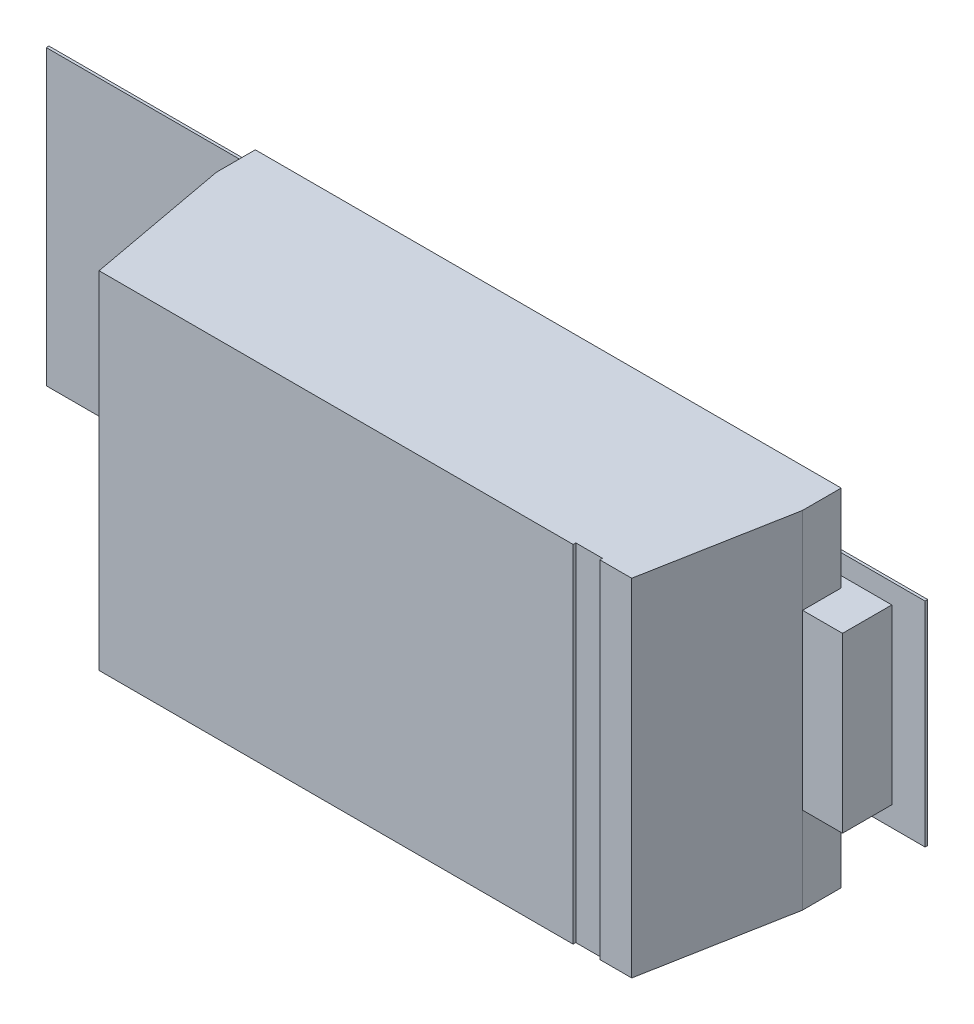
ISO-10303-21;
HEADER;
FILE_DESCRIPTION(('STEP AP214'),'2;1');
FILE_NAME('part.step','',(''),(''),'','','');
FILE_SCHEMA(('AUTOMOTIVE_DESIGN { 1 0 10303 214 1 1 1 1 }'));
ENDSEC;
DATA;
#1=APPLICATION_CONTEXT('core data for automotive mechanical design processes');
#2=APPLICATION_PROTOCOL_DEFINITION('international standard','automotive_design',2000,#1);
#3=PRODUCT_CONTEXT('',#1,'mechanical');
#4=PRODUCT('Part','Part','',(#3));
#5=PRODUCT_RELATED_PRODUCT_CATEGORY('part','',(#4));
#6=PRODUCT_DEFINITION_FORMATION('','',#4);
#7=PRODUCT_DEFINITION_CONTEXT('part definition',#1,'design');
#8=PRODUCT_DEFINITION('design','',#6,#7);
#9=PRODUCT_DEFINITION_SHAPE('','',#8);
#10=(LENGTH_UNIT() NAMED_UNIT(*) SI_UNIT(.MILLI.,.METRE.));
#11=(NAMED_UNIT(*) PLANE_ANGLE_UNIT() SI_UNIT($,.RADIAN.));
#12=(NAMED_UNIT(*) SI_UNIT($,.STERADIAN.) SOLID_ANGLE_UNIT());
#13=UNCERTAINTY_MEASURE_WITH_UNIT(LENGTH_MEASURE(1.E-05),#10,'distance_accuracy_value','');
#14=(GEOMETRIC_REPRESENTATION_CONTEXT(3) GLOBAL_UNCERTAINTY_ASSIGNED_CONTEXT((#13)) GLOBAL_UNIT_ASSIGNED_CONTEXT((#10,
#11,#12)) REPRESENTATION_CONTEXT('',''));
#15=CARTESIAN_POINT('',(0.,0.,0.));
#16=DIRECTION('',(0.,0.,1.));
#17=DIRECTION('',(1.,0.,0.));
#18=AXIS2_PLACEMENT_3D('',#15,#16,#17);
#19=CARTESIAN_POINT('',(0.,0.,0.0762));
#20=DIRECTION('',(0.,0.,1.));
#21=DIRECTION('',(1.,0.,0.));
#22=AXIS2_PLACEMENT_3D('',#19,#20,#21);
#23=PLANE('',#22);
#24=DIRECTION('',(1.,0.,0.));
#25=VECTOR('',#24,1.);
#26=CARTESIAN_POINT('',(-1.92499999999992,-0.550000000000086,0.0762));
#27=LINE('',#26,#25);
#28=CARTESIAN_POINT('',(-1.92499999999992,-0.550000000000086,0.0762));
#29=VERTEX_POINT('',#28);
#30=CARTESIAN_POINT('',(0.0750000000000049,-0.550000000000086,0.0762));
#31=VERTEX_POINT('',#30);
#32=EDGE_CURVE('E212',#29,#31,#27,.T.);
#33=ORIENTED_EDGE('',*,*,#32,.F.);
#34=DIRECTION('',(0.,1.,0.));
#35=VECTOR('',#34,1.);
#36=CARTESIAN_POINT('',(-1.92499999999992,0.550000000000086,0.0762));
#37=LINE('',#36,#35);
#38=CARTESIAN_POINT('',(-1.92499999999992,0.550000000000086,0.0762));
#39=VERTEX_POINT('',#38);
#40=EDGE_CURVE('E20',#39,#29,#37,.F.);
#41=ORIENTED_EDGE('',*,*,#40,.F.);
#42=DIRECTION('',(1.,0.,0.));
#43=VECTOR('',#42,1.);
#44=CARTESIAN_POINT('',(0.0750000000000048,0.550000000000086,0.0762));
#45=LINE('',#44,#43);
#46=CARTESIAN_POINT('',(0.0750000000000048,0.550000000000086,0.0762));
#47=VERTEX_POINT('',#46);
#48=EDGE_CURVE('E240',#47,#39,#45,.F.);
#49=ORIENTED_EDGE('',*,*,#48,.F.);
#50=DIRECTION('',(0.,1.,0.));
#51=VECTOR('',#50,1.);
#52=CARTESIAN_POINT('',(0.0750000000000048,-0.550000000000086,0.0762));
#53=LINE('',#52,#51);
#54=EDGE_CURVE('E225',#31,#47,#53,.T.);
#55=ORIENTED_EDGE('',*,*,#54,.F.);
#56=EDGE_LOOP('',(#33,#41,#49,#55));
#57=FACE_BOUND('',#56,.T.);
#58=ADVANCED_FACE('F17',(#57),#23,.F.);
#59=CARTESIAN_POINT('',(0.,0.,0.0762));
#60=DIRECTION('',(0.,0.,1.));
#61=DIRECTION('',(1.,0.,0.));
#62=AXIS2_PLACEMENT_3D('',#59,#60,#61);
#63=PLANE('',#62);
#64=DIRECTION('',(0.,1.,0.));
#65=VECTOR('',#64,1.);
#66=CARTESIAN_POINT('',(1.37500000000009,-0.399999999999924,0.0762));
#67=LINE('',#66,#65);
#68=CARTESIAN_POINT('',(1.37500000000009,-0.399999999999924,0.0762));
#69=VERTEX_POINT('',#68);
#70=CARTESIAN_POINT('',(1.37500000000009,0.399999999999924,0.0762));
#71=VERTEX_POINT('',#70);
#72=EDGE_CURVE('E247',#69,#71,#67,.T.);
#73=ORIENTED_EDGE('',*,*,#72,.F.);
#74=DIRECTION('',(1.,0.,0.));
#75=VECTOR('',#74,1.);
#76=CARTESIAN_POINT('',(0.574999999999986,-0.399999999999924,0.0762));
#77=LINE('',#76,#75);
#78=CARTESIAN_POINT('',(0.574999999999986,-0.399999999999924,0.0762));
#79=VERTEX_POINT('',#78);
#80=EDGE_CURVE('E242',#79,#69,#77,.T.);
#81=ORIENTED_EDGE('',*,*,#80,.F.);
#82=DIRECTION('',(0.,1.,0.));
#83=VECTOR('',#82,1.);
#84=CARTESIAN_POINT('',(0.574999999999986,0.399999999999924,0.0762));
#85=LINE('',#84,#83);
#86=CARTESIAN_POINT('',(0.574999999999986,0.399999999999924,0.0762));
#87=VERTEX_POINT('',#86);
#88=EDGE_CURVE('E260',#87,#79,#85,.F.);
#89=ORIENTED_EDGE('',*,*,#88,.F.);
#90=DIRECTION('',(1.,0.,0.));
#91=VECTOR('',#90,1.);
#92=CARTESIAN_POINT('',(1.37500000000009,0.399999999999924,0.0762));
#93=LINE('',#92,#91);
#94=EDGE_CURVE('E252',#71,#87,#93,.F.);
#95=ORIENTED_EDGE('',*,*,#94,.F.);
#96=EDGE_LOOP('',(#73,#81,#89,#95));
#97=FACE_BOUND('',#96,.T.);
#98=ADVANCED_FACE('F821',(#97),#63,.F.);
#99=CARTESIAN_POINT('',(-1.92499999999992,0.550000000000086,0.0762));
#100=DIRECTION('',(-1.,0.,0.));
#101=DIRECTION('',(0.,0.,1.));
#102=AXIS2_PLACEMENT_3D('',#99,#100,#101);
#103=PLANE('',#102);
#104=DIRECTION('',(0.,0.,1.));
#105=VECTOR('',#104,1.);
#106=CARTESIAN_POINT('',(-1.92499999999992,0.550000000000086,0.0762));
#107=LINE('',#106,#105);
#108=CARTESIAN_POINT('',(-1.92499999999992,0.550000000000086,0.0862000000000108));
#109=VERTEX_POINT('',#108);
#110=EDGE_CURVE('E221',#39,#109,#107,.T.);
#111=ORIENTED_EDGE('',*,*,#110,.F.);
#112=ORIENTED_EDGE('',*,*,#40,.T.);
#113=DIRECTION('',(0.,0.,-1.));
#114=VECTOR('',#113,1.);
#115=CARTESIAN_POINT('',(-1.92499999999992,-0.550000000000086,0.0762));
#116=LINE('',#115,#114);
#117=CARTESIAN_POINT('',(-1.92499999999992,-0.550000000000086,0.0862000000000108));
#118=VERTEX_POINT('',#117);
#119=EDGE_CURVE('E218',#118,#29,#116,.T.);
#120=ORIENTED_EDGE('',*,*,#119,.F.);
#121=DIRECTION('',(0.,1.,0.));
#122=VECTOR('',#121,1.);
#123=CARTESIAN_POINT('',(-1.92499999999992,0.,0.0862000000000108));
#124=LINE('',#123,#122);
#125=EDGE_CURVE('E263',#109,#118,#124,.F.);
#126=ORIENTED_EDGE('',*,*,#125,.F.);
#127=EDGE_LOOP('',(#111,#112,#120,#126));
#128=FACE_BOUND('',#127,.T.);
#129=ADVANCED_FACE('F217',(#128),#103,.T.);
#130=CARTESIAN_POINT('',(-1.92499999999992,-0.550000000000086,0.0762));
#131=DIRECTION('',(0.,-1.,0.));
#132=DIRECTION('',(0.,0.,-1.));
#133=AXIS2_PLACEMENT_3D('',#130,#131,#132);
#134=PLANE('',#133);
#135=ORIENTED_EDGE('',*,*,#119,.T.);
#136=ORIENTED_EDGE('',*,*,#32,.T.);
#137=DIRECTION('',(0.,0.,-1.));
#138=VECTOR('',#137,1.);
#139=CARTESIAN_POINT('',(0.0750000000000048,-0.550000000000086,0.0762));
#140=LINE('',#139,#138);
#141=CARTESIAN_POINT('',(0.0750000000000049,-0.550000000000086,0.0862000000000108));
#142=VERTEX_POINT('',#141);
#143=EDGE_CURVE('E227',#142,#31,#140,.T.);
#144=ORIENTED_EDGE('',*,*,#143,.F.);
#145=DIRECTION('',(1.,0.,0.));
#146=VECTOR('',#145,1.);
#147=CARTESIAN_POINT('',(0.,-0.550000000000086,0.0862000000000108));
#148=LINE('',#147,#146);
#149=EDGE_CURVE('E231',#118,#142,#148,.T.);
#150=ORIENTED_EDGE('',*,*,#149,.F.);
#151=EDGE_LOOP('',(#135,#136,#144,#150));
#152=FACE_BOUND('',#151,.T.);
#153=ADVANCED_FACE('F229',(#152),#134,.T.);
#154=CARTESIAN_POINT('',(0.0750000000000048,-0.550000000000086,0.0762));
#155=DIRECTION('',(1.,0.,0.));
#156=DIRECTION('',(0.,0.,-1.));
#157=AXIS2_PLACEMENT_3D('',#154,#155,#156);
#158=PLANE('',#157);
#159=ORIENTED_EDGE('',*,*,#143,.T.);
#160=ORIENTED_EDGE('',*,*,#54,.T.);
#161=DIRECTION('',(0.,0.,1.));
#162=VECTOR('',#161,1.);
#163=CARTESIAN_POINT('',(0.0750000000000048,0.550000000000086,0.0762));
#164=LINE('',#163,#162);
#165=CARTESIAN_POINT('',(0.0750000000000048,0.550000000000086,0.0862000000000108));
#166=VERTEX_POINT('',#165);
#167=EDGE_CURVE('E237',#166,#47,#164,.F.);
#168=ORIENTED_EDGE('',*,*,#167,.F.);
#169=DIRECTION('',(0.,1.,0.));
#170=VECTOR('',#169,1.);
#171=CARTESIAN_POINT('',(0.0750000000000048,0.,0.0862000000000108));
#172=LINE('',#171,#170);
#173=EDGE_CURVE('E266',#142,#166,#172,.T.);
#174=ORIENTED_EDGE('',*,*,#173,.F.);
#175=EDGE_LOOP('',(#159,#160,#168,#174));
#176=FACE_BOUND('',#175,.T.);
#177=ADVANCED_FACE('F794',(#176),#158,.T.);
#178=CARTESIAN_POINT('',(0.0750000000000048,0.550000000000086,0.0762));
#179=DIRECTION('',(0.,1.,0.));
#180=DIRECTION('',(0.,0.,1.));
#181=AXIS2_PLACEMENT_3D('',#178,#179,#180);
#182=PLANE('',#181);
#183=ORIENTED_EDGE('',*,*,#167,.T.);
#184=ORIENTED_EDGE('',*,*,#48,.T.);
#185=ORIENTED_EDGE('',*,*,#110,.T.);
#186=DIRECTION('',(1.,0.,0.));
#187=VECTOR('',#186,1.);
#188=CARTESIAN_POINT('',(0.,0.550000000000086,0.0862000000000108));
#189=LINE('',#188,#187);
#190=EDGE_CURVE('E269',#166,#109,#189,.F.);
#191=ORIENTED_EDGE('',*,*,#190,.F.);
#192=EDGE_LOOP('',(#183,#184,#185,#191));
#193=FACE_BOUND('',#192,.T.);
#194=ADVANCED_FACE('F784',(#193),#182,.T.);
#195=CARTESIAN_POINT('',(0.574999999999986,-0.399999999999924,0.0762));
#196=DIRECTION('',(0.,-1.,0.));
#197=DIRECTION('',(0.,0.,-1.));
#198=AXIS2_PLACEMENT_3D('',#195,#196,#197);
#199=PLANE('',#198);
#200=DIRECTION('',(0.,0.,1.));
#201=VECTOR('',#200,1.);
#202=CARTESIAN_POINT('',(0.574999999999986,-0.399999999999924,0.0762));
#203=LINE('',#202,#201);
#204=CARTESIAN_POINT('',(0.574999999999986,-0.399999999999924,0.0862000000000108));
#205=VERTEX_POINT('',#204);
#206=EDGE_CURVE('E254',#79,#205,#203,.T.);
#207=ORIENTED_EDGE('',*,*,#206,.F.);
#208=ORIENTED_EDGE('',*,*,#80,.T.);
#209=DIRECTION('',(0.,0.,-1.));
#210=VECTOR('',#209,1.);
#211=CARTESIAN_POINT('',(1.37500000000009,-0.399999999999924,0.0762));
#212=LINE('',#211,#210);
#213=CARTESIAN_POINT('',(1.37500000000009,-0.399999999999924,0.0862000000000108));
#214=VERTEX_POINT('',#213);
#215=EDGE_CURVE('E244',#214,#69,#212,.T.);
#216=ORIENTED_EDGE('',*,*,#215,.F.);
#217=DIRECTION('',(1.,0.,0.));
#218=VECTOR('',#217,1.);
#219=CARTESIAN_POINT('',(0.,-0.399999999999924,0.0862000000000108));
#220=LINE('',#219,#218);
#221=EDGE_CURVE('E277',#205,#214,#220,.T.);
#222=ORIENTED_EDGE('',*,*,#221,.F.);
#223=EDGE_LOOP('',(#207,#208,#216,#222));
#224=FACE_BOUND('',#223,.T.);
#225=ADVANCED_FACE('F774',(#224),#199,.T.);
#226=CARTESIAN_POINT('',(1.37500000000009,-0.399999999999924,0.0762));
#227=DIRECTION('',(1.,0.,0.));
#228=DIRECTION('',(0.,0.,-1.));
#229=AXIS2_PLACEMENT_3D('',#226,#227,#228);
#230=PLANE('',#229);
#231=ORIENTED_EDGE('',*,*,#215,.T.);
#232=ORIENTED_EDGE('',*,*,#72,.T.);
#233=DIRECTION('',(0.,0.,1.));
#234=VECTOR('',#233,1.);
#235=CARTESIAN_POINT('',(1.37500000000009,0.399999999999924,0.0762));
#236=LINE('',#235,#234);
#237=CARTESIAN_POINT('',(1.37500000000009,0.399999999999924,0.0862000000000108));
#238=VERTEX_POINT('',#237);
#239=EDGE_CURVE('E249',#238,#71,#236,.F.);
#240=ORIENTED_EDGE('',*,*,#239,.F.);
#241=DIRECTION('',(0.,1.,0.));
#242=VECTOR('',#241,1.);
#243=CARTESIAN_POINT('',(1.37500000000009,0.,0.0862000000000108));
#244=LINE('',#243,#242);
#245=EDGE_CURVE('E280',#214,#238,#244,.T.);
#246=ORIENTED_EDGE('',*,*,#245,.F.);
#247=EDGE_LOOP('',(#231,#232,#240,#246));
#248=FACE_BOUND('',#247,.T.);
#249=ADVANCED_FACE('F764',(#248),#230,.T.);
#250=CARTESIAN_POINT('',(1.37500000000009,0.399999999999924,0.0762));
#251=DIRECTION('',(0.,1.,0.));
#252=DIRECTION('',(0.,0.,1.));
#253=AXIS2_PLACEMENT_3D('',#250,#251,#252);
#254=PLANE('',#253);
#255=ORIENTED_EDGE('',*,*,#239,.T.);
#256=ORIENTED_EDGE('',*,*,#94,.T.);
#257=DIRECTION('',(0.,0.,1.));
#258=VECTOR('',#257,1.);
#259=CARTESIAN_POINT('',(0.574999999999986,0.399999999999924,0.0762));
#260=LINE('',#259,#258);
#261=CARTESIAN_POINT('',(0.574999999999986,0.399999999999924,0.0862000000000108));
#262=VERTEX_POINT('',#261);
#263=EDGE_CURVE('E257',#262,#87,#260,.F.);
#264=ORIENTED_EDGE('',*,*,#263,.F.);
#265=DIRECTION('',(1.,0.,0.));
#266=VECTOR('',#265,1.);
#267=CARTESIAN_POINT('',(0.,0.399999999999924,0.0862000000000108));
#268=LINE('',#267,#266);
#269=EDGE_CURVE('E283',#238,#262,#268,.F.);
#270=ORIENTED_EDGE('',*,*,#269,.F.);
#271=EDGE_LOOP('',(#255,#256,#264,#270));
#272=FACE_BOUND('',#271,.T.);
#273=ADVANCED_FACE('F754',(#272),#254,.T.);
#274=CARTESIAN_POINT('',(0.574999999999986,0.399999999999924,0.0762));
#275=DIRECTION('',(-1.,0.,0.));
#276=DIRECTION('',(0.,0.,1.));
#277=AXIS2_PLACEMENT_3D('',#274,#275,#276);
#278=PLANE('',#277);
#279=ORIENTED_EDGE('',*,*,#263,.T.);
#280=ORIENTED_EDGE('',*,*,#88,.T.);
#281=ORIENTED_EDGE('',*,*,#206,.T.);
#282=DIRECTION('',(0.,1.,0.));
#283=VECTOR('',#282,1.);
#284=CARTESIAN_POINT('',(0.574999999999986,0.,0.0862000000000108));
#285=LINE('',#284,#283);
#286=EDGE_CURVE('E286',#262,#205,#285,.F.);
#287=ORIENTED_EDGE('',*,*,#286,.F.);
#288=EDGE_LOOP('',(#279,#280,#281,#287));
#289=FACE_BOUND('',#288,.T.);
#290=ADVANCED_FACE('F745',(#289),#278,.T.);
#291=CARTESIAN_POINT('',(-1.25000000000008,0.32499999999997,0.0762));
#292=DIRECTION('',(-1.,0.,0.));
#293=DIRECTION('',(0.,0.,1.));
#294=AXIS2_PLACEMENT_3D('',#291,#292,#293);
#295=PLANE('',#294);
#296=DIRECTION('',(0.,0.,1.));
#297=VECTOR('',#296,1.);
#298=CARTESIAN_POINT('',(-1.25000000000008,0.32499999999997,0.0762));
#299=LINE('',#298,#297);
#300=CARTESIAN_POINT('',(-1.25000000000008,0.32499999999997,0.0862000000000108));
#301=VERTEX_POINT('',#300);
#302=CARTESIAN_POINT('',(-1.25000000000008,0.32499999999997,0.271199999999982));
#303=VERTEX_POINT('',#302);
#304=EDGE_CURVE('E305',#301,#303,#299,.T.);
#305=ORIENTED_EDGE('',*,*,#304,.F.);
#306=DIRECTION('',(0.,1.,0.));
#307=VECTOR('',#306,1.);
#308=CARTESIAN_POINT('',(-1.25000000000008,0.,0.0862000000000108));
#309=LINE('',#308,#307);
#310=CARTESIAN_POINT('',(-1.25000000000008,-0.32499999999997,0.0862000000000108));
#311=VERTEX_POINT('',#310);
#312=EDGE_CURVE('E274',#311,#301,#309,.T.);
#313=ORIENTED_EDGE('',*,*,#312,.F.);
#314=DIRECTION('',(0.,0.,-1.));
#315=VECTOR('',#314,1.);
#316=CARTESIAN_POINT('',(-1.25000000000008,-0.32499999999997,0.0762));
#317=LINE('',#316,#315);
#318=CARTESIAN_POINT('',(-1.25000000000008,-0.32499999999997,0.271199999999982));
#319=VERTEX_POINT('',#318);
#320=EDGE_CURVE('E297',#319,#311,#317,.T.);
#321=ORIENTED_EDGE('',*,*,#320,.F.);
#322=DIRECTION('',(0.,1.,0.));
#323=VECTOR('',#322,1.);
#324=CARTESIAN_POINT('',(-1.25000000000008,0.,0.271199999999982));
#325=LINE('',#324,#323);
#326=EDGE_CURVE('E292',#303,#319,#325,.F.);
#327=ORIENTED_EDGE('',*,*,#326,.F.);
#328=EDGE_LOOP('',(#305,#313,#321,#327));
#329=FACE_BOUND('',#328,.T.);
#330=ADVANCED_FACE('F514',(#329),#295,.T.);
#331=CARTESIAN_POINT('',(0.,0.,0.0862000000000108));
#332=DIRECTION('',(0.,0.,1.));
#333=DIRECTION('',(1.,0.,0.));
#334=AXIS2_PLACEMENT_3D('',#331,#332,#333);
#335=PLANE('',#334);
#336=DIRECTION('',(1.,0.,0.));
#337=VECTOR('',#336,1.);
#338=CARTESIAN_POINT('',(-1.25000000000008,-0.32499999999997,0.0862000000000108));
#339=LINE('',#338,#337);
#340=CARTESIAN_POINT('',(0.0500000000000032,-0.32499999999997,0.0862000000000108));
#341=VERTEX_POINT('',#340);
#342=EDGE_CURVE('E300',#311,#341,#339,.T.);
#343=ORIENTED_EDGE('',*,*,#342,.F.);
#344=ORIENTED_EDGE('',*,*,#312,.T.);
#345=DIRECTION('',(1.,0.,0.));
#346=VECTOR('',#345,1.);
#347=CARTESIAN_POINT('',(0.0500000000000032,0.32499999999997,0.0862000000000108));
#348=LINE('',#347,#346);
#349=CARTESIAN_POINT('',(0.0500000000000032,0.32499999999997,0.0862000000000108));
#350=VERTEX_POINT('',#349);
#351=EDGE_CURVE('E310',#350,#301,#348,.F.);
#352=ORIENTED_EDGE('',*,*,#351,.F.);
#353=DIRECTION('',(0.,1.,0.));
#354=VECTOR('',#353,1.);
#355=CARTESIAN_POINT('',(0.0500000000000032,0.,0.0862000000000108));
#356=LINE('',#355,#354);
#357=EDGE_CURVE('E272',#350,#341,#356,.F.);
#358=ORIENTED_EDGE('',*,*,#357,.T.);
#359=EDGE_LOOP('',(#343,#344,#352,#358));
#360=FACE_BOUND('',#359,.T.);
#361=ORIENTED_EDGE('',*,*,#173,.T.);
#362=ORIENTED_EDGE('',*,*,#190,.T.);
#363=ORIENTED_EDGE('',*,*,#125,.T.);
#364=ORIENTED_EDGE('',*,*,#149,.T.);
#365=EDGE_LOOP('',(#361,#362,#363,#364));
#366=FACE_BOUND('',#365,.T.);
#367=ADVANCED_FACE('F509',(#360,#366),#335,.T.);
#368=CARTESIAN_POINT('',(1.25000000000008,-0.32499999999997,0.0762));
#369=DIRECTION('',(1.,0.,0.));
#370=DIRECTION('',(0.,0.,-1.));
#371=AXIS2_PLACEMENT_3D('',#368,#369,#370);
#372=PLANE('',#371);
#373=DIRECTION('',(0.,0.,-1.));
#374=VECTOR('',#373,1.);
#375=CARTESIAN_POINT('',(1.25000000000008,-0.32499999999997,0.0762));
#376=LINE('',#375,#374);
#377=CARTESIAN_POINT('',(1.25000000000008,-0.32499999999997,0.0862000000000108));
#378=VERTEX_POINT('',#377);
#379=CARTESIAN_POINT('',(1.25000000000008,-0.32499999999997,0.271199999999982));
#380=VERTEX_POINT('',#379);
#381=EDGE_CURVE('E333',#378,#380,#376,.F.);
#382=ORIENTED_EDGE('',*,*,#381,.F.);
#383=DIRECTION('',(0.,1.,0.));
#384=VECTOR('',#383,1.);
#385=CARTESIAN_POINT('',(1.25000000000008,0.,0.0862000000000108));
#386=LINE('',#385,#384);
#387=CARTESIAN_POINT('',(1.25000000000008,0.32499999999997,0.0862000000000108));
#388=VERTEX_POINT('',#387);
#389=EDGE_CURVE('E289',#388,#378,#386,.F.);
#390=ORIENTED_EDGE('',*,*,#389,.F.);
#391=DIRECTION('',(0.,0.,1.));
#392=VECTOR('',#391,1.);
#393=CARTESIAN_POINT('',(1.25000000000008,0.32499999999997,0.0762));
#394=LINE('',#393,#392);
#395=CARTESIAN_POINT('',(1.25000000000008,0.32499999999997,0.271199999999982));
#396=VERTEX_POINT('',#395);
#397=EDGE_CURVE('E327',#396,#388,#394,.F.);
#398=ORIENTED_EDGE('',*,*,#397,.F.);
#399=DIRECTION('',(0.,1.,0.));
#400=VECTOR('',#399,1.);
#401=CARTESIAN_POINT('',(1.25000000000008,0.,0.271199999999982));
#402=LINE('',#401,#400);
#403=EDGE_CURVE('E319',#380,#396,#402,.T.);
#404=ORIENTED_EDGE('',*,*,#403,.F.);
#405=EDGE_LOOP('',(#382,#390,#398,#404));
#406=FACE_BOUND('',#405,.T.);
#407=ADVANCED_FACE('F718',(#406),#372,.T.);
#408=CARTESIAN_POINT('',(0.,0.,0.0862000000000108));
#409=DIRECTION('',(0.,0.,1.));
#410=DIRECTION('',(1.,0.,0.));
#411=AXIS2_PLACEMENT_3D('',#408,#409,#410);
#412=PLANE('',#411);
#413=DIRECTION('',(1.,0.,0.));
#414=VECTOR('',#413,1.);
#415=CARTESIAN_POINT('',(0.599999999999886,-0.32499999999997,0.0862000000000108));
#416=LINE('',#415,#414);
#417=CARTESIAN_POINT('',(0.599999999999886,-0.32499999999997,0.0862000000000108));
#418=VERTEX_POINT('',#417);
#419=EDGE_CURVE('E342',#418,#378,#416,.T.);
#420=ORIENTED_EDGE('',*,*,#419,.F.);
#421=DIRECTION('',(0.,1.,0.));
#422=VECTOR('',#421,1.);
#423=CARTESIAN_POINT('',(0.599999999999886,0.32499999999997,0.0862000000000108));
#424=LINE('',#423,#422);
#425=CARTESIAN_POINT('',(0.599999999999886,0.32499999999997,0.0862000000000108));
#426=VERTEX_POINT('',#425);
#427=EDGE_CURVE('E303',#426,#418,#424,.F.);
#428=ORIENTED_EDGE('',*,*,#427,.F.);
#429=DIRECTION('',(1.,0.,0.));
#430=VECTOR('',#429,1.);
#431=CARTESIAN_POINT('',(1.25000000000008,0.32499999999997,0.0862000000000108));
#432=LINE('',#431,#430);
#433=EDGE_CURVE('E330',#388,#426,#432,.F.);
#434=ORIENTED_EDGE('',*,*,#433,.F.);
#435=ORIENTED_EDGE('',*,*,#389,.T.);
#436=EDGE_LOOP('',(#420,#428,#434,#435));
#437=FACE_BOUND('',#436,.T.);
#438=ORIENTED_EDGE('',*,*,#269,.T.);
#439=ORIENTED_EDGE('',*,*,#286,.T.);
#440=ORIENTED_EDGE('',*,*,#221,.T.);
#441=ORIENTED_EDGE('',*,*,#245,.T.);
#442=EDGE_LOOP('',(#438,#439,#440,#441));
#443=FACE_BOUND('',#442,.T.);
#444=ADVANCED_FACE('F530',(#437,#443),#412,.T.);
#445=CARTESIAN_POINT('',(0.,0.,0.271199999999982));
#446=DIRECTION('',(0.,0.,1.));
#447=DIRECTION('',(1.,0.,0.));
#448=AXIS2_PLACEMENT_3D('',#445,#446,#447);
#449=PLANE('',#448);
#450=ORIENTED_EDGE('',*,*,#326,.T.);
#451=DIRECTION('',(1.,0.,0.));
#452=VECTOR('',#451,1.);
#453=CARTESIAN_POINT('',(-1.25000000000008,-0.32499999999997,0.271199999999982));
#454=LINE('',#453,#452);
#455=CARTESIAN_POINT('',(-1.09999999999992,-0.32499999999997,0.271199999999982));
#456=VERTEX_POINT('',#455);
#457=EDGE_CURVE('E294',#456,#319,#454,.F.);
#458=ORIENTED_EDGE('',*,*,#457,.F.);
#459=DIRECTION('',(0.,1.,0.));
#460=VECTOR('',#459,1.);
#461=CARTESIAN_POINT('',(-1.09999999999992,0.64999999999994,0.271199999999982));
#462=LINE('',#461,#460);
#463=CARTESIAN_POINT('',(-1.09999999999992,0.32499999999997,0.271199999999982));
#464=VERTEX_POINT('',#463);
#465=EDGE_CURVE('E348',#464,#456,#462,.F.);
#466=ORIENTED_EDGE('',*,*,#465,.F.);
#467=DIRECTION('',(1.,0.,0.));
#468=VECTOR('',#467,1.);
#469=CARTESIAN_POINT('',(0.0500000000000032,0.32499999999997,0.271199999999982));
#470=LINE('',#469,#468);
#471=EDGE_CURVE('E308',#303,#464,#470,.T.);
#472=ORIENTED_EDGE('',*,*,#471,.F.);
#473=EDGE_LOOP('',(#450,#458,#466,#472));
#474=FACE_BOUND('',#473,.T.);
#475=ADVANCED_FACE('F517',(#474),#449,.T.);
#476=CARTESIAN_POINT('',(-1.25000000000008,-0.32499999999997,0.0762));
#477=DIRECTION('',(0.,-1.,0.));
#478=DIRECTION('',(0.,0.,-1.));
#479=AXIS2_PLACEMENT_3D('',#476,#477,#478);
#480=PLANE('',#479);
#481=ORIENTED_EDGE('',*,*,#320,.T.);
#482=ORIENTED_EDGE('',*,*,#342,.T.);
#483=DIRECTION('',(0.,0.,-1.));
#484=VECTOR('',#483,1.);
#485=CARTESIAN_POINT('',(0.0500000000000032,-0.32499999999997,0.0762));
#486=LINE('',#485,#484);
#487=CARTESIAN_POINT('',(0.0500000000000032,-0.32499999999997,0.126200000000003));
#488=VERTEX_POINT('',#487);
#489=EDGE_CURVE('E316',#488,#341,#486,.T.);
#490=ORIENTED_EDGE('',*,*,#489,.F.);
#491=DIRECTION('',(1.,0.,0.));
#492=VECTOR('',#491,1.);
#493=CARTESIAN_POINT('',(1.09999999999992,-0.32499999999997,0.126200000000003));
#494=LINE('',#493,#492);
#495=CARTESIAN_POINT('',(-1.09999999999992,-0.32499999999997,0.126200000000003));
#496=VERTEX_POINT('',#495);
#497=EDGE_CURVE('E354',#488,#496,#494,.F.);
#498=ORIENTED_EDGE('',*,*,#497,.T.);
#499=DIRECTION('',(0.,0.,1.));
#500=VECTOR('',#499,1.);
#501=CARTESIAN_POINT('',(-1.09999999999992,-0.32499999999997,0.0762));
#502=LINE('',#501,#500);
#503=EDGE_CURVE('E351',#456,#496,#502,.F.);
#504=ORIENTED_EDGE('',*,*,#503,.F.);
#505=ORIENTED_EDGE('',*,*,#457,.T.);
#506=EDGE_LOOP('',(#481,#482,#490,#498,#504,#505));
#507=FACE_BOUND('',#506,.T.);
#508=ADVANCED_FACE('F519',(#507),#480,.T.);
#509=CARTESIAN_POINT('',(0.599999999999886,0.32499999999997,0.0762));
#510=DIRECTION('',(-1.,0.,0.));
#511=DIRECTION('',(0.,0.,1.));
#512=AXIS2_PLACEMENT_3D('',#509,#510,#511);
#513=PLANE('',#512);
#514=DIRECTION('',(0.,0.,1.));
#515=VECTOR('',#514,1.);
#516=CARTESIAN_POINT('',(0.599999999999886,0.32499999999997,0.0762));
#517=LINE('',#516,#515);
#518=CARTESIAN_POINT('',(0.599999999999886,0.32499999999997,0.126200000000003));
#519=VERTEX_POINT('',#518);
#520=EDGE_CURVE('E321',#426,#519,#517,.T.);
#521=ORIENTED_EDGE('',*,*,#520,.F.);
#522=ORIENTED_EDGE('',*,*,#427,.T.);
#523=DIRECTION('',(0.,0.,-1.));
#524=VECTOR('',#523,1.);
#525=CARTESIAN_POINT('',(0.599999999999886,-0.32499999999997,0.0762));
#526=LINE('',#525,#524);
#527=CARTESIAN_POINT('',(0.599999999999886,-0.32499999999997,0.126200000000003));
#528=VERTEX_POINT('',#527);
#529=EDGE_CURVE('E339',#528,#418,#526,.T.);
#530=ORIENTED_EDGE('',*,*,#529,.F.);
#531=DIRECTION('',(0.,1.,0.));
#532=VECTOR('',#531,1.);
#533=CARTESIAN_POINT('',(0.599999999999886,-0.64999999999994,0.126200000000003));
#534=LINE('',#533,#532);
#535=EDGE_CURVE('E361',#528,#519,#534,.T.);
#536=ORIENTED_EDGE('',*,*,#535,.T.);
#537=EDGE_LOOP('',(#521,#522,#530,#536));
#538=FACE_BOUND('',#537,.T.);
#539=ADVANCED_FACE('F521',(#538),#513,.T.);
#540=CARTESIAN_POINT('',(0.0500000000000032,0.32499999999997,0.0762));
#541=DIRECTION('',(0.,1.,0.));
#542=DIRECTION('',(0.,0.,1.));
#543=AXIS2_PLACEMENT_3D('',#540,#541,#542);
#544=PLANE('',#543);
#545=DIRECTION('',(0.,0.,-1.));
#546=VECTOR('',#545,1.);
#547=CARTESIAN_POINT('',(0.0500000000000032,0.32499999999997,0.0762));
#548=LINE('',#547,#546);
#549=CARTESIAN_POINT('',(0.0500000000000032,0.32499999999997,0.126200000000003));
#550=VERTEX_POINT('',#549);
#551=EDGE_CURVE('E313',#350,#550,#548,.F.);
#552=ORIENTED_EDGE('',*,*,#551,.F.);
#553=ORIENTED_EDGE('',*,*,#351,.T.);
#554=ORIENTED_EDGE('',*,*,#304,.T.);
#555=ORIENTED_EDGE('',*,*,#471,.T.);
#556=DIRECTION('',(0.,0.,1.));
#557=VECTOR('',#556,1.);
#558=CARTESIAN_POINT('',(-1.09999999999992,0.32499999999997,0.0762));
#559=LINE('',#558,#557);
#560=CARTESIAN_POINT('',(-1.09999999999992,0.32499999999997,0.126200000000003));
#561=VERTEX_POINT('',#560);
#562=EDGE_CURVE('E345',#561,#464,#559,.T.);
#563=ORIENTED_EDGE('',*,*,#562,.F.);
#564=DIRECTION('',(1.,0.,0.));
#565=VECTOR('',#564,1.);
#566=CARTESIAN_POINT('',(1.09999999999992,0.32499999999997,0.126200000000003));
#567=LINE('',#566,#565);
#568=EDGE_CURVE('E368',#561,#550,#567,.T.);
#569=ORIENTED_EDGE('',*,*,#568,.T.);
#570=EDGE_LOOP('',(#552,#553,#554,#555,#563,#569));
#571=FACE_BOUND('',#570,.T.);
#572=ADVANCED_FACE('F503',(#571),#544,.T.);
#573=CARTESIAN_POINT('',(0.0500000000000032,-0.32499999999997,0.0762));
#574=DIRECTION('',(1.,0.,0.));
#575=DIRECTION('',(0.,0.,-1.));
#576=AXIS2_PLACEMENT_3D('',#573,#574,#575);
#577=PLANE('',#576);
#578=ORIENTED_EDGE('',*,*,#489,.T.);
#579=ORIENTED_EDGE('',*,*,#357,.F.);
#580=ORIENTED_EDGE('',*,*,#551,.T.);
#581=DIRECTION('',(0.,1.,0.));
#582=VECTOR('',#581,1.);
#583=CARTESIAN_POINT('',(0.0500000000000032,-0.64999999999994,0.126200000000003));
#584=LINE('',#583,#582);
#585=EDGE_CURVE('E370',#550,#488,#584,.F.);
#586=ORIENTED_EDGE('',*,*,#585,.T.);
#587=EDGE_LOOP('',(#578,#579,#580,#586));
#588=FACE_BOUND('',#587,.T.);
#589=ADVANCED_FACE('F505',(#588),#577,.T.);
#590=CARTESIAN_POINT('',(0.,0.,0.271199999999982));
#591=DIRECTION('',(0.,0.,1.));
#592=DIRECTION('',(1.,0.,0.));
#593=AXIS2_PLACEMENT_3D('',#590,#591,#592);
#594=PLANE('',#593);
#595=DIRECTION('',(0.,1.,0.));
#596=VECTOR('',#595,1.);
#597=CARTESIAN_POINT('',(1.09999999999992,-0.64999999999994,0.271199999999982));
#598=LINE('',#597,#596);
#599=CARTESIAN_POINT('',(1.09999999999992,-0.32499999999997,0.271199999999982));
#600=VERTEX_POINT('',#599);
#601=CARTESIAN_POINT('',(1.09999999999992,0.32499999999997,0.271199999999982));
#602=VERTEX_POINT('',#601);
#603=EDGE_CURVE('E373',#600,#602,#598,.T.);
#604=ORIENTED_EDGE('',*,*,#603,.F.);
#605=DIRECTION('',(1.,0.,0.));
#606=VECTOR('',#605,1.);
#607=CARTESIAN_POINT('',(0.599999999999886,-0.32499999999997,0.271199999999982));
#608=LINE('',#607,#606);
#609=EDGE_CURVE('E336',#380,#600,#608,.F.);
#610=ORIENTED_EDGE('',*,*,#609,.F.);
#611=ORIENTED_EDGE('',*,*,#403,.T.);
#612=DIRECTION('',(1.,0.,0.));
#613=VECTOR('',#612,1.);
#614=CARTESIAN_POINT('',(1.25000000000008,0.32499999999997,0.271199999999982));
#615=LINE('',#614,#613);
#616=EDGE_CURVE('E324',#602,#396,#615,.T.);
#617=ORIENTED_EDGE('',*,*,#616,.F.);
#618=EDGE_LOOP('',(#604,#610,#611,#617));
#619=FACE_BOUND('',#618,.T.);
#620=ADVANCED_FACE('F566',(#619),#594,.T.);
#621=CARTESIAN_POINT('',(1.25000000000008,0.32499999999997,0.0762));
#622=DIRECTION('',(0.,1.,0.));
#623=DIRECTION('',(0.,0.,1.));
#624=AXIS2_PLACEMENT_3D('',#621,#622,#623);
#625=PLANE('',#624);
#626=ORIENTED_EDGE('',*,*,#397,.T.);
#627=ORIENTED_EDGE('',*,*,#433,.T.);
#628=ORIENTED_EDGE('',*,*,#520,.T.);
#629=DIRECTION('',(1.,0.,0.));
#630=VECTOR('',#629,1.);
#631=CARTESIAN_POINT('',(1.09999999999992,0.32499999999997,0.126200000000003));
#632=LINE('',#631,#630);
#633=CARTESIAN_POINT('',(1.09999999999992,0.32499999999997,0.126200000000003));
#634=VERTEX_POINT('',#633);
#635=EDGE_CURVE('E363',#519,#634,#632,.T.);
#636=ORIENTED_EDGE('',*,*,#635,.T.);
#637=DIRECTION('',(0.,0.,-1.));
#638=VECTOR('',#637,1.);
#639=CARTESIAN_POINT('',(1.09999999999992,0.32499999999997,0.0762));
#640=LINE('',#639,#638);
#641=EDGE_CURVE('E376',#602,#634,#640,.T.);
#642=ORIENTED_EDGE('',*,*,#641,.F.);
#643=ORIENTED_EDGE('',*,*,#616,.T.);
#644=EDGE_LOOP('',(#626,#627,#628,#636,#642,#643));
#645=FACE_BOUND('',#644,.T.);
#646=ADVANCED_FACE('F562',(#645),#625,.T.);
#647=CARTESIAN_POINT('',(0.599999999999886,-0.32499999999997,0.0762));
#648=DIRECTION('',(0.,-1.,0.));
#649=DIRECTION('',(0.,0.,-1.));
#650=AXIS2_PLACEMENT_3D('',#647,#648,#649);
#651=PLANE('',#650);
#652=ORIENTED_EDGE('',*,*,#529,.T.);
#653=ORIENTED_EDGE('',*,*,#419,.T.);
#654=ORIENTED_EDGE('',*,*,#381,.T.);
#655=ORIENTED_EDGE('',*,*,#609,.T.);
#656=DIRECTION('',(0.,0.,-1.));
#657=VECTOR('',#656,1.);
#658=CARTESIAN_POINT('',(1.09999999999992,-0.32499999999997,0.0762));
#659=LINE('',#658,#657);
#660=CARTESIAN_POINT('',(1.09999999999992,-0.32499999999997,0.126200000000003));
#661=VERTEX_POINT('',#660);
#662=EDGE_CURVE('E384',#661,#600,#659,.F.);
#663=ORIENTED_EDGE('',*,*,#662,.F.);
#664=DIRECTION('',(1.,0.,0.));
#665=VECTOR('',#664,1.);
#666=CARTESIAN_POINT('',(1.09999999999992,-0.32499999999997,0.126200000000003));
#667=LINE('',#666,#665);
#668=EDGE_CURVE('E358',#661,#528,#667,.F.);
#669=ORIENTED_EDGE('',*,*,#668,.T.);
#670=EDGE_LOOP('',(#652,#653,#654,#655,#663,#669));
#671=FACE_BOUND('',#670,.T.);
#672=ADVANCED_FACE('F559',(#671),#651,.T.);
#673=CARTESIAN_POINT('',(-1.09999999999992,0.64999999999994,0.0762));
#674=DIRECTION('',(-1.,0.,0.));
#675=DIRECTION('',(0.,0.,1.));
#676=AXIS2_PLACEMENT_3D('',#673,#674,#675);
#677=PLANE('',#676);
#678=ORIENTED_EDGE('',*,*,#465,.T.);
#679=ORIENTED_EDGE('',*,*,#503,.T.);
#680=DIRECTION('',(0.,1.,0.));
#681=VECTOR('',#680,1.);
#682=CARTESIAN_POINT('',(-1.09999999999992,-0.64999999999994,0.126200000000003));
#683=LINE('',#682,#681);
#684=CARTESIAN_POINT('',(-1.09999999999992,-0.64999999999994,0.126200000000003));
#685=VERTEX_POINT('',#684);
#686=EDGE_CURVE('E356',#496,#685,#683,.F.);
#687=ORIENTED_EDGE('',*,*,#686,.T.);
#688=DIRECTION('',(0.,0.,-1.));
#689=VECTOR('',#688,1.);
#690=CARTESIAN_POINT('',(-1.09999999999992,-0.64999999999994,0.0762));
#691=LINE('',#690,#689);
#692=CARTESIAN_POINT('',(-1.09999999999992,-0.64999999999994,0.272199999999978));
#693=VERTEX_POINT('',#692);
#694=EDGE_CURVE('E424',#693,#685,#691,.T.);
#695=ORIENTED_EDGE('',*,*,#694,.F.);
#696=DIRECTION('',(0.,1.,0.));
#697=VECTOR('',#696,1.);
#698=CARTESIAN_POINT('',(-1.09999999999992,-0.64999999999994,0.272199999999978));
#699=LINE('',#698,#697);
#700=CARTESIAN_POINT('',(-1.09999999999992,0.64999999999994,0.272199999999978));
#701=VERTEX_POINT('',#700);
#702=EDGE_CURVE('E418',#693,#701,#699,.T.);
#703=ORIENTED_EDGE('',*,*,#702,.T.);
#704=DIRECTION('',(0.,0.,1.));
#705=VECTOR('',#704,1.);
#706=CARTESIAN_POINT('',(-1.09999999999992,0.64999999999994,0.0762));
#707=LINE('',#706,#705);
#708=CARTESIAN_POINT('',(-1.09999999999992,0.64999999999994,0.126200000000003));
#709=VERTEX_POINT('',#708);
#710=EDGE_CURVE('E411',#709,#701,#707,.T.);
#711=ORIENTED_EDGE('',*,*,#710,.F.);
#712=DIRECTION('',(0.,1.,0.));
#713=VECTOR('',#712,1.);
#714=CARTESIAN_POINT('',(-1.09999999999992,-0.64999999999994,0.126200000000003));
#715=LINE('',#714,#713);
#716=EDGE_CURVE('E365',#709,#561,#715,.F.);
#717=ORIENTED_EDGE('',*,*,#716,.T.);
#718=ORIENTED_EDGE('',*,*,#562,.T.);
#719=EDGE_LOOP('',(#678,#679,#687,#695,#703,#711,#717,#718));
#720=FACE_BOUND('',#719,.T.);
#721=ADVANCED_FACE('F467',(#720),#677,.T.);
#722=CARTESIAN_POINT('',(1.09999999999992,-0.64999999999994,0.126200000000003));
#723=DIRECTION('',(0.,0.,1.));
#724=DIRECTION('',(1.,0.,0.));
#725=AXIS2_PLACEMENT_3D('',#722,#723,#724);
#726=PLANE('',#725);
#727=ORIENTED_EDGE('',*,*,#568,.F.);
#728=ORIENTED_EDGE('',*,*,#716,.F.);
#729=DIRECTION('',(1.,0.,0.));
#730=VECTOR('',#729,1.);
#731=CARTESIAN_POINT('',(1.09999999999992,0.64999999999994,0.126200000000003));
#732=LINE('',#731,#730);
#733=CARTESIAN_POINT('',(1.09999999999992,0.64999999999994,0.126200000000003));
#734=VERTEX_POINT('',#733);
#735=EDGE_CURVE('E408',#734,#709,#732,.F.);
#736=ORIENTED_EDGE('',*,*,#735,.F.);
#737=DIRECTION('',(0.,1.,0.));
#738=VECTOR('',#737,1.);
#739=CARTESIAN_POINT('',(1.09999999999992,-0.64999999999994,0.126200000000003));
#740=LINE('',#739,#738);
#741=EDGE_CURVE('E379',#634,#734,#740,.T.);
#742=ORIENTED_EDGE('',*,*,#741,.F.);
#743=ORIENTED_EDGE('',*,*,#635,.F.);
#744=ORIENTED_EDGE('',*,*,#535,.F.);
#745=ORIENTED_EDGE('',*,*,#668,.F.);
#746=DIRECTION('',(0.,1.,0.));
#747=VECTOR('',#746,1.);
#748=CARTESIAN_POINT('',(1.09999999999992,-0.64999999999994,0.126200000000003));
#749=LINE('',#748,#747);
#750=CARTESIAN_POINT('',(1.09999999999992,-0.64999999999994,0.126200000000003));
#751=VERTEX_POINT('',#750);
#752=EDGE_CURVE('E381',#751,#661,#749,.T.);
#753=ORIENTED_EDGE('',*,*,#752,.F.);
#754=DIRECTION('',(1.,0.,0.));
#755=VECTOR('',#754,1.);
#756=CARTESIAN_POINT('',(-1.09999999999992,-0.64999999999994,0.126200000000003));
#757=LINE('',#756,#755);
#758=EDGE_CURVE('E427',#685,#751,#757,.T.);
#759=ORIENTED_EDGE('',*,*,#758,.F.);
#760=ORIENTED_EDGE('',*,*,#686,.F.);
#761=ORIENTED_EDGE('',*,*,#497,.F.);
#762=ORIENTED_EDGE('',*,*,#585,.F.);
#763=EDGE_LOOP('',(#727,#728,#736,#742,#743,#744,#745,#753,#759,#760,#761,#762));
#764=FACE_BOUND('',#763,.T.);
#765=ADVANCED_FACE('F474',(#764),#726,.F.);
#766=CARTESIAN_POINT('',(1.09999999999992,-0.64999999999994,0.0762));
#767=DIRECTION('',(1.,0.,0.));
#768=DIRECTION('',(0.,0.,-1.));
#769=AXIS2_PLACEMENT_3D('',#766,#767,#768);
#770=PLANE('',#769);
#771=ORIENTED_EDGE('',*,*,#752,.T.);
#772=ORIENTED_EDGE('',*,*,#662,.T.);
#773=ORIENTED_EDGE('',*,*,#603,.T.);
#774=ORIENTED_EDGE('',*,*,#641,.T.);
#775=ORIENTED_EDGE('',*,*,#741,.T.);
#776=DIRECTION('',(0.,0.,1.));
#777=VECTOR('',#776,1.);
#778=CARTESIAN_POINT('',(1.09999999999992,0.64999999999994,0.0762));
#779=LINE('',#778,#777);
#780=CARTESIAN_POINT('',(1.09999999999999,0.64999999999994,0.272199999999991));
#781=VERTEX_POINT('',#780);
#782=EDGE_CURVE('E405',#781,#734,#779,.F.);
#783=ORIENTED_EDGE('',*,*,#782,.F.);
#784=DIRECTION('',(0.,1.,0.));
#785=VECTOR('',#784,1.);
#786=CARTESIAN_POINT('',(1.10000000000006,-0.64999999999994,0.272200000000005));
#787=LINE('',#786,#785);
#788=CARTESIAN_POINT('',(1.09999999999995,-0.64999999999994,0.272199999999985));
#789=VERTEX_POINT('',#788);
#790=EDGE_CURVE('E387',#781,#789,#787,.F.);
#791=ORIENTED_EDGE('',*,*,#790,.T.);
#792=DIRECTION('',(0.,0.,-1.));
#793=VECTOR('',#792,1.);
#794=CARTESIAN_POINT('',(1.09999999999992,-0.64999999999994,0.0762));
#795=LINE('',#794,#793);
#796=EDGE_CURVE('E430',#751,#789,#795,.F.);
#797=ORIENTED_EDGE('',*,*,#796,.F.);
#798=EDGE_LOOP('',(#771,#772,#773,#774,#775,#783,#791,#797));
#799=FACE_BOUND('',#798,.T.);
#800=ADVANCED_FACE('F478',(#799),#770,.T.);
#801=CARTESIAN_POINT('',(1.00000000000006,-0.64999999999994,0.8128));
#802=DIRECTION('',(-0.983318171348509,0.,-0.181893853375602));
#803=DIRECTION('',(-0.181893853375602,0.,0.983318171348509));
#804=AXIS2_PLACEMENT_3D('',#801,#802,#803);
#805=PLANE('',#804);
#806=DIRECTION('',(-0.181893853375338,0.,0.983318171348557));
#807=VECTOR('',#806,1.);
#808=CARTESIAN_POINT('',(1.09999999999992,-0.64999999999994,0.272199999999978));
#809=LINE('',#808,#807);
#810=CARTESIAN_POINT('',(1.00000000000006,-0.64999999999994,0.8128));
#811=VERTEX_POINT('',#810);
#812=EDGE_CURVE('E433',#789,#811,#809,.T.);
#813=ORIENTED_EDGE('',*,*,#812,.F.);
#814=ORIENTED_EDGE('',*,*,#790,.F.);
#815=DIRECTION('',(0.181893853375339,0.,-0.983318171348557));
#816=VECTOR('',#815,1.);
#817=CARTESIAN_POINT('',(1.00000000000006,0.64999999999994,0.8128));
#818=LINE('',#817,#816);
#819=CARTESIAN_POINT('',(1.00000000000006,0.64999999999994,0.8128));
#820=VERTEX_POINT('',#819);
#821=EDGE_CURVE('E402',#820,#781,#818,.T.);
#822=ORIENTED_EDGE('',*,*,#821,.F.);
#823=DIRECTION('',(0.,1.,0.));
#824=VECTOR('',#823,1.);
#825=CARTESIAN_POINT('',(1.00000000000006,0.,0.8128));
#826=LINE('',#825,#824);
#827=EDGE_CURVE('E389',#811,#820,#826,.T.);
#828=ORIENTED_EDGE('',*,*,#827,.F.);
#829=EDGE_LOOP('',(#813,#814,#822,#828));
#830=FACE_BOUND('',#829,.T.);
#831=ADVANCED_FACE('F482',(#830),#805,.F.);
#832=CARTESIAN_POINT('',(0.,0.,0.8128));
#833=DIRECTION('',(0.,0.,1.));
#834=DIRECTION('',(1.,0.,0.));
#835=AXIS2_PLACEMENT_3D('',#832,#833,#834);
#836=PLANE('',#835);
#837=DIRECTION('',(1.,0.,0.));
#838=VECTOR('',#837,1.);
#839=CARTESIAN_POINT('',(1.09999999999992,0.64999999999994,0.8128));
#840=LINE('',#839,#838);
#841=CARTESIAN_POINT('',(0.880000000000036,0.64999999999994,0.8128));
#842=VERTEX_POINT('',#841);
#843=EDGE_CURVE('E399',#842,#820,#840,.T.);
#844=ORIENTED_EDGE('',*,*,#843,.F.);
#845=DIRECTION('',(0.,1.,0.));
#846=VECTOR('',#845,1.);
#847=CARTESIAN_POINT('',(0.880000000000036,-0.64999999999994,0.8128));
#848=LINE('',#847,#846);
#849=CARTESIAN_POINT('',(0.880000000000036,-0.64999999999994,0.8128));
#850=VERTEX_POINT('',#849);
#851=EDGE_CURVE('E391',#842,#850,#848,.F.);
#852=ORIENTED_EDGE('',*,*,#851,.T.);
#853=DIRECTION('',(1.,0.,0.));
#854=VECTOR('',#853,1.);
#855=CARTESIAN_POINT('',(-1.09999999999992,-0.64999999999994,0.8128));
#856=LINE('',#855,#854);
#857=EDGE_CURVE('E436',#811,#850,#856,.F.);
#858=ORIENTED_EDGE('',*,*,#857,.F.);
#859=ORIENTED_EDGE('',*,*,#827,.T.);
#860=EDGE_LOOP('',(#844,#852,#858,#859));
#861=FACE_BOUND('',#860,.T.);
#862=ADVANCED_FACE('F486',(#861),#836,.T.);
#863=CARTESIAN_POINT('',(0.880000000000036,-0.64999999999994,0.8128));
#864=DIRECTION('',(1.,0.,0.));
#865=DIRECTION('',(0.,0.,-1.));
#866=AXIS2_PLACEMENT_3D('',#863,#864,#865);
#867=PLANE('',#866);
#868=DIRECTION('',(0.,1.,0.));
#869=VECTOR('',#868,1.);
#870=CARTESIAN_POINT('',(0.880000000000036,0.,0.80280000000004));
#871=LINE('',#870,#869);
#872=CARTESIAN_POINT('',(0.880000000000036,-0.64999999999994,0.80280000000004));
#873=VERTEX_POINT('',#872);
#874=CARTESIAN_POINT('',(0.880000000000036,0.64999999999994,0.80280000000004));
#875=VERTEX_POINT('',#874);
#876=EDGE_CURVE('E393',#873,#875,#871,.T.);
#877=ORIENTED_EDGE('',*,*,#876,.F.);
#878=DIRECTION('',(0.,0.,-1.));
#879=VECTOR('',#878,1.);
#880=CARTESIAN_POINT('',(0.880000000000036,-0.64999999999994,0.0762));
#881=LINE('',#880,#879);
#882=EDGE_CURVE('E439',#850,#873,#881,.T.);
#883=ORIENTED_EDGE('',*,*,#882,.F.);
#884=ORIENTED_EDGE('',*,*,#851,.F.);
#885=DIRECTION('',(0.,0.,1.));
#886=VECTOR('',#885,1.);
#887=CARTESIAN_POINT('',(0.880000000000036,0.64999999999994,0.0762));
#888=LINE('',#887,#886);
#889=EDGE_CURVE('E396',#875,#842,#888,.T.);
#890=ORIENTED_EDGE('',*,*,#889,.F.);
#891=EDGE_LOOP('',(#877,#883,#884,#890));
#892=FACE_BOUND('',#891,.T.);
#893=ADVANCED_FACE('F490',(#892),#867,.F.);
#894=CARTESIAN_POINT('',(0.,0.,0.80280000000004));
#895=DIRECTION('',(0.,0.,1.));
#896=DIRECTION('',(1.,0.,0.));
#897=AXIS2_PLACEMENT_3D('',#894,#895,#896);
#898=PLANE('',#897);
#899=DIRECTION('',(0.,1.,0.));
#900=VECTOR('',#899,1.);
#901=CARTESIAN_POINT('',(0.779999999999928,0.64999999999994,0.80280000000004));
#902=LINE('',#901,#900);
#903=CARTESIAN_POINT('',(0.779999999999928,0.64999999999994,0.80280000000004));
#904=VERTEX_POINT('',#903);
#905=CARTESIAN_POINT('',(0.779999999999928,-0.64999999999994,0.80280000000004));
#906=VERTEX_POINT('',#905);
#907=EDGE_CURVE('E447',#904,#906,#902,.F.);
#908=ORIENTED_EDGE('',*,*,#907,.T.);
#909=DIRECTION('',(1.,0.,0.));
#910=VECTOR('',#909,1.);
#911=CARTESIAN_POINT('',(-1.09999999999992,-0.64999999999994,0.80280000000004));
#912=LINE('',#911,#910);
#913=EDGE_CURVE('E442',#873,#906,#912,.F.);
#914=ORIENTED_EDGE('',*,*,#913,.F.);
#915=ORIENTED_EDGE('',*,*,#876,.T.);
#916=DIRECTION('',(1.,0.,0.));
#917=VECTOR('',#916,1.);
#918=CARTESIAN_POINT('',(1.09999999999992,0.64999999999994,0.80280000000004));
#919=LINE('',#918,#917);
#920=EDGE_CURVE('E413',#904,#875,#919,.T.);
#921=ORIENTED_EDGE('',*,*,#920,.F.);
#922=EDGE_LOOP('',(#908,#914,#915,#921));
#923=FACE_BOUND('',#922,.T.);
#924=ADVANCED_FACE('F492',(#923),#898,.T.);
#925=CARTESIAN_POINT('',(1.09999999999992,0.64999999999994,0.0762));
#926=DIRECTION('',(0.,1.,0.));
#927=DIRECTION('',(0.,0.,1.));
#928=AXIS2_PLACEMENT_3D('',#925,#926,#927);
#929=PLANE('',#928);
#930=DIRECTION('',(0.,0.,1.));
#931=VECTOR('',#930,1.);
#932=CARTESIAN_POINT('',(0.779999999999928,0.64999999999994,0.8128));
#933=LINE('',#932,#931);
#934=CARTESIAN_POINT('',(0.779999999999928,0.64999999999994,0.8128));
#935=VERTEX_POINT('',#934);
#936=EDGE_CURVE('E444',#935,#904,#933,.F.);
#937=ORIENTED_EDGE('',*,*,#936,.T.);
#938=ORIENTED_EDGE('',*,*,#920,.T.);
#939=ORIENTED_EDGE('',*,*,#889,.T.);
#940=ORIENTED_EDGE('',*,*,#843,.T.);
#941=ORIENTED_EDGE('',*,*,#821,.T.);
#942=ORIENTED_EDGE('',*,*,#782,.T.);
#943=ORIENTED_EDGE('',*,*,#735,.T.);
#944=ORIENTED_EDGE('',*,*,#710,.T.);
#945=DIRECTION('',(-0.181893853375602,0.,-0.983318171348509));
#946=VECTOR('',#945,1.);
#947=CARTESIAN_POINT('',(-1.09999999999992,0.64999999999994,0.272199999999978));
#948=LINE('',#947,#946);
#949=CARTESIAN_POINT('',(-1.00000000000003,0.64999999999994,0.812799999999993));
#950=VERTEX_POINT('',#949);
#951=EDGE_CURVE('E416',#701,#950,#948,.F.);
#952=ORIENTED_EDGE('',*,*,#951,.T.);
#953=DIRECTION('',(1.,0.,0.));
#954=VECTOR('',#953,1.);
#955=CARTESIAN_POINT('',(0.,0.64999999999994,0.8128));
#956=LINE('',#955,#954);
#957=EDGE_CURVE('E450',#935,#950,#956,.F.);
#958=ORIENTED_EDGE('',*,*,#957,.F.);
#959=EDGE_LOOP('',(#937,#938,#939,#940,#941,#942,#943,#944,#952,#958));
#960=FACE_BOUND('',#959,.T.);
#961=ADVANCED_FACE('F498',(#960),#929,.T.);
#962=CARTESIAN_POINT('',(-1.09999999999992,-0.64999999999994,0.272199999999978));
#963=DIRECTION('',(0.983318171348509,0.,-0.181893853375602));
#964=DIRECTION('',(-0.181893853375602,0.,-0.983318171348509));
#965=AXIS2_PLACEMENT_3D('',#962,#963,#964);
#966=PLANE('',#965);
#967=DIRECTION('',(-0.181893853375339,0.,-0.983318171348557));
#968=VECTOR('',#967,1.);
#969=CARTESIAN_POINT('',(-1.00000000000006,-0.64999999999994,0.8128));
#970=LINE('',#969,#968);
#971=CARTESIAN_POINT('',(-0.999999999999992,-0.64999999999994,0.812799999999987));
#972=VERTEX_POINT('',#971);
#973=EDGE_CURVE('E421',#972,#693,#970,.T.);
#974=ORIENTED_EDGE('',*,*,#973,.F.);
#975=DIRECTION('',(0.,1.,0.));
#976=VECTOR('',#975,1.);
#977=CARTESIAN_POINT('',(-1.00000000000006,0.,0.8128));
#978=LINE('',#977,#976);
#979=EDGE_CURVE('E453',#950,#972,#978,.F.);
#980=ORIENTED_EDGE('',*,*,#979,.F.);
#981=ORIENTED_EDGE('',*,*,#951,.F.);
#982=ORIENTED_EDGE('',*,*,#702,.F.);
#983=EDGE_LOOP('',(#974,#980,#981,#982));
#984=FACE_BOUND('',#983,.T.);
#985=ADVANCED_FACE('F463',(#984),#966,.F.);
#986=CARTESIAN_POINT('',(-1.09999999999992,-0.64999999999994,0.0762));
#987=DIRECTION('',(0.,-1.,0.));
#988=DIRECTION('',(0.,0.,-1.));
#989=AXIS2_PLACEMENT_3D('',#986,#987,#988);
#990=PLANE('',#989);
#991=ORIENTED_EDGE('',*,*,#882,.T.);
#992=ORIENTED_EDGE('',*,*,#913,.T.);
#993=DIRECTION('',(0.,0.,1.));
#994=VECTOR('',#993,1.);
#995=CARTESIAN_POINT('',(0.779999999999928,-0.64999999999994,0.8128));
#996=LINE('',#995,#994);
#997=CARTESIAN_POINT('',(0.779999999999928,-0.64999999999994,0.8128));
#998=VERTEX_POINT('',#997);
#999=EDGE_CURVE('E35',#906,#998,#996,.T.);
#1000=ORIENTED_EDGE('',*,*,#999,.T.);
#1001=DIRECTION('',(1.,0.,0.));
#1002=VECTOR('',#1001,1.);
#1003=CARTESIAN_POINT('',(0.,-0.64999999999994,0.8128));
#1004=LINE('',#1003,#1002);
#1005=EDGE_CURVE('E26',#972,#998,#1004,.T.);
#1006=ORIENTED_EDGE('',*,*,#1005,.F.);
#1007=ORIENTED_EDGE('',*,*,#973,.T.);
#1008=ORIENTED_EDGE('',*,*,#694,.T.);
#1009=ORIENTED_EDGE('',*,*,#758,.T.);
#1010=ORIENTED_EDGE('',*,*,#796,.T.);
#1011=ORIENTED_EDGE('',*,*,#812,.T.);
#1012=ORIENTED_EDGE('',*,*,#857,.T.);
#1013=EDGE_LOOP('',(#991,#992,#1000,#1006,#1007,#1008,#1009,#1010,#1011,#1012));
#1014=FACE_BOUND('',#1013,.T.);
#1015=ADVANCED_FACE('F460',(#1014),#990,.T.);
#1016=CARTESIAN_POINT('',(0.779999999999928,0.64999999999994,0.8128));
#1017=DIRECTION('',(-1.,0.,0.));
#1018=DIRECTION('',(0.,0.,1.));
#1019=AXIS2_PLACEMENT_3D('',#1016,#1017,#1018);
#1020=PLANE('',#1019);
#1021=ORIENTED_EDGE('',*,*,#907,.F.);
#1022=ORIENTED_EDGE('',*,*,#936,.F.);
#1023=DIRECTION('',(0.,1.,0.));
#1024=VECTOR('',#1023,1.);
#1025=CARTESIAN_POINT('',(0.779999999999928,0.,0.8128));
#1026=LINE('',#1025,#1024);
#1027=EDGE_CURVE('E11',#998,#935,#1026,.T.);
#1028=ORIENTED_EDGE('',*,*,#1027,.F.);
#1029=ORIENTED_EDGE('',*,*,#999,.F.);
#1030=EDGE_LOOP('',(#1021,#1022,#1028,#1029));
#1031=FACE_BOUND('',#1030,.T.);
#1032=ADVANCED_FACE('F496',(#1031),#1020,.F.);
#1033=CARTESIAN_POINT('',(0.,0.,0.8128));
#1034=DIRECTION('',(0.,0.,1.));
#1035=DIRECTION('',(1.,0.,0.));
#1036=AXIS2_PLACEMENT_3D('',#1033,#1034,#1035);
#1037=PLANE('',#1036);
#1038=ORIENTED_EDGE('',*,*,#1005,.T.);
#1039=ORIENTED_EDGE('',*,*,#1027,.T.);
#1040=ORIENTED_EDGE('',*,*,#957,.T.);
#1041=ORIENTED_EDGE('',*,*,#979,.T.);
#1042=EDGE_LOOP('',(#1038,#1039,#1040,#1041));
#1043=FACE_BOUND('',#1042,.T.);
#1044=ADVANCED_FACE('F458',(#1043),#1037,.T.);
#1045=CLOSED_SHELL('',(#58,#98,#129,#153,#177,#194,#225,#249,#273,#290,#330,#367,#407,#444,#475,
#508,#539,#572,#589,#620,#646,#672,#721,#765,#800,#831,#862,#893,#924,#961,#985,#1015,#1032,#1044));
#1046=MANIFOLD_SOLID_BREP('B1',#1045);
#1047=ADVANCED_BREP_SHAPE_REPRESENTATION('',(#18,#1046),#14);
#1048=SHAPE_DEFINITION_REPRESENTATION(#9,#1047);
ENDSEC;
END-ISO-10303-21;
